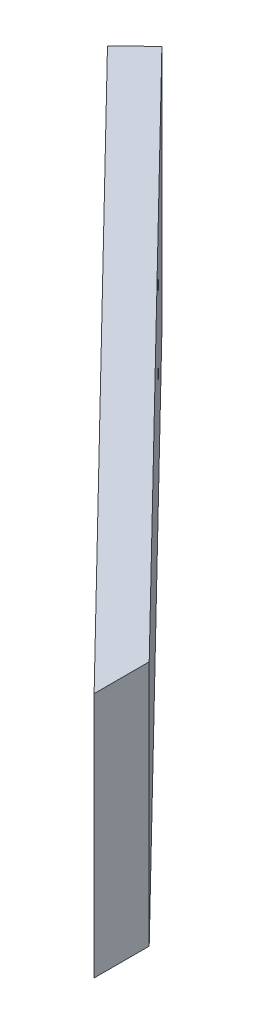
ISO-10303-21;
HEADER;
FILE_DESCRIPTION(('STEP AP214'),'2;1');
FILE_NAME('part.step','',(''),(''),'','','');
FILE_SCHEMA(('AUTOMOTIVE_DESIGN { 1 0 10303 214 1 1 1 1 }'));
ENDSEC;
DATA;
#1=APPLICATION_CONTEXT('core data for automotive mechanical design processes');
#2=APPLICATION_PROTOCOL_DEFINITION('international standard','automotive_design',2000,#1);
#3=PRODUCT_CONTEXT('',#1,'mechanical');
#4=PRODUCT('Part','Part','',(#3));
#5=PRODUCT_RELATED_PRODUCT_CATEGORY('part','',(#4));
#6=PRODUCT_DEFINITION_FORMATION('','',#4);
#7=PRODUCT_DEFINITION_CONTEXT('part definition',#1,'design');
#8=PRODUCT_DEFINITION('design','',#6,#7);
#9=PRODUCT_DEFINITION_SHAPE('','',#8);
#10=(LENGTH_UNIT() NAMED_UNIT(*) SI_UNIT(.MILLI.,.METRE.));
#11=(NAMED_UNIT(*) PLANE_ANGLE_UNIT() SI_UNIT($,.RADIAN.));
#12=(NAMED_UNIT(*) SI_UNIT($,.STERADIAN.) SOLID_ANGLE_UNIT());
#13=UNCERTAINTY_MEASURE_WITH_UNIT(LENGTH_MEASURE(1.E-05),#10,'distance_accuracy_value','');
#14=(GEOMETRIC_REPRESENTATION_CONTEXT(3) GLOBAL_UNCERTAINTY_ASSIGNED_CONTEXT((#13)) GLOBAL_UNIT_ASSIGNED_CONTEXT((#10,
#11,#12)) REPRESENTATION_CONTEXT('',''));
#15=CARTESIAN_POINT('',(0.,0.,0.));
#16=DIRECTION('',(0.,0.,1.));
#17=DIRECTION('',(1.,0.,0.));
#18=AXIS2_PLACEMENT_3D('',#15,#16,#17);
#19=CARTESIAN_POINT('',(0.,32.,30.));
#20=DIRECTION('',(0.715474021164313,0.,-0.698639338313388));
#21=DIRECTION('',(-0.698639338313388,0.,-0.715474021164313));
#22=AXIS2_PLACEMENT_3D('',#19,#20,#21);
#23=PLANE('',#22);
#24=CARTESIAN_POINT('',(45.2113149470892,7.,76.3007442229227));
#25=DIRECTION('',(0.715474021164313,0.,-0.698639338313388));
#26=DIRECTION('',(-0.698639338313388,0.,-0.715474021164313));
#27=AXIS2_PLACEMENT_3D('',#24,#25,#26);
#28=CIRCLE('',#27,1.10000000000001);
#29=CARTESIAN_POINT('',(44.4428116749445,7.,75.5137227996419));
#30=VERTEX_POINT('',#29);
#31=EDGE_CURVE('E111',#30,#30,#28,.T.);
#32=ORIENTED_EDGE('',*,*,#31,.T.);
#33=EDGE_LOOP('',(#32));
#34=FACE_BOUND('',#33,.T.);
#35=CARTESIAN_POINT('',(59.184101713357,15.,90.6102246462089));
#36=DIRECTION('',(0.715474021164313,0.,-0.698639338313388));
#37=DIRECTION('',(-0.698639338313388,0.,-0.715474021164313));
#38=AXIS2_PLACEMENT_3D('',#35,#36,#37);
#39=CIRCLE('',#38,1.10000000000002);
#40=CARTESIAN_POINT('',(58.4155984412122,15.,89.8232032229282));
#41=VERTEX_POINT('',#40);
#42=EDGE_CURVE('E116',#41,#41,#39,.T.);
#43=ORIENTED_EDGE('',*,*,#42,.T.);
#44=EDGE_LOOP('',(#43));
#45=FACE_BOUND('',#44,.T.);
#46=CARTESIAN_POINT('',(31.2385281808215,15.,61.9912637996364));
#47=DIRECTION('',(0.715474021164313,0.,-0.698639338313388));
#48=DIRECTION('',(-0.698639338313388,0.,-0.715474021164313));
#49=AXIS2_PLACEMENT_3D('',#46,#47,#48);
#50=CIRCLE('',#49,1.10000000000001);
#51=CARTESIAN_POINT('',(30.4700249086767,15.,61.2042423763557));
#52=VERTEX_POINT('',#51);
#53=EDGE_CURVE('E119',#52,#52,#50,.T.);
#54=ORIENTED_EDGE('',*,*,#53,.T.);
#55=EDGE_LOOP('',(#54));
#56=FACE_BOUND('',#55,.T.);
#57=CARTESIAN_POINT('',(59.184101713357,25.,90.6102246462089));
#58=DIRECTION('',(0.715474021164313,0.,-0.698639338313388));
#59=DIRECTION('',(-0.698639338313388,0.,-0.715474021164313));
#60=AXIS2_PLACEMENT_3D('',#57,#58,#59);
#61=CIRCLE('',#60,1.10000000000001);
#62=CARTESIAN_POINT('',(58.4155984412122,25.,89.8232032229282));
#63=VERTEX_POINT('',#62);
#64=EDGE_CURVE('E122',#63,#63,#61,.T.);
#65=ORIENTED_EDGE('',*,*,#64,.T.);
#66=EDGE_LOOP('',(#65));
#67=FACE_BOUND('',#66,.T.);
#68=CARTESIAN_POINT('',(45.2113149470892,17.,76.3007442229227));
#69=DIRECTION('',(0.715474021164313,0.,-0.698639338313388));
#70=DIRECTION('',(-0.698639338313388,0.,-0.715474021164313));
#71=AXIS2_PLACEMENT_3D('',#68,#69,#70);
#72=CIRCLE('',#71,1.10000000000001);
#73=CARTESIAN_POINT('',(44.4428116749445,17.,75.5137227996419));
#74=VERTEX_POINT('',#73);
#75=EDGE_CURVE('E125',#74,#74,#72,.T.);
#76=ORIENTED_EDGE('',*,*,#75,.T.);
#77=EDGE_LOOP('',(#76));
#78=FACE_BOUND('',#77,.T.);
#79=CARTESIAN_POINT('',(31.2385281808215,25.,61.9912637996364));
#80=DIRECTION('',(0.715474021164313,0.,-0.698639338313388));
#81=DIRECTION('',(-0.698639338313388,0.,-0.715474021164313));
#82=AXIS2_PLACEMENT_3D('',#79,#80,#81);
#83=CIRCLE('',#82,1.10000000000001);
#84=CARTESIAN_POINT('',(30.4700249086767,25.,61.2042423763557));
#85=VERTEX_POINT('',#84);
#86=EDGE_CURVE('E128',#85,#85,#83,.T.);
#87=ORIENTED_EDGE('',*,*,#86,.T.);
#88=EDGE_LOOP('',(#87));
#89=FACE_BOUND('',#88,.T.);
#90=CARTESIAN_POINT('',(13.0959180149402,26.,43.4114823044568));
#91=DIRECTION('',(0.715474021164313,0.,-0.698639338313388));
#92=DIRECTION('',(-0.698639338313388,0.,-0.715474021164313));
#93=AXIS2_PLACEMENT_3D('',#90,#91,#92);
#94=CIRCLE('',#93,1.1);
#95=CARTESIAN_POINT('',(12.3274147427955,26.,42.624460881176));
#96=VERTEX_POINT('',#95);
#97=EDGE_CURVE('E100',#96,#96,#94,.T.);
#98=ORIENTED_EDGE('',*,*,#97,.T.);
#99=EDGE_LOOP('',(#98));
#100=FACE_BOUND('',#99,.T.);
#101=CARTESIAN_POINT('',(13.0959180149402,6.,43.4114823044568));
#102=DIRECTION('',(0.715474021164313,0.,-0.698639338313388));
#103=DIRECTION('',(-0.698639338313388,0.,-0.715474021164313));
#104=AXIS2_PLACEMENT_3D('',#101,#102,#103);
#105=CIRCLE('',#104,1.1);
#106=CARTESIAN_POINT('',(12.3274147427955,6.,42.624460881176));
#107=VERTEX_POINT('',#106);
#108=EDGE_CURVE('E104',#107,#107,#105,.T.);
#109=ORIENTED_EDGE('',*,*,#108,.T.);
#110=EDGE_LOOP('',(#109));
#111=FACE_BOUND('',#110,.T.);
#112=DIRECTION('',(0.,1.,0.));
#113=VECTOR('',#112,1.);
#114=CARTESIAN_POINT('',(11.,0.,41.2650602409639));
#115=LINE('',#114,#113);
#116=CARTESIAN_POINT('',(11.,0.,41.2650602409639));
#117=VERTEX_POINT('',#116);
#118=CARTESIAN_POINT('',(11.,32.,41.2650602409639));
#119=VERTEX_POINT('',#118);
#120=EDGE_CURVE('E93',#117,#119,#115,.T.);
#121=ORIENTED_EDGE('',*,*,#120,.F.);
#122=DIRECTION('',(0.698639338313388,0.,0.715474021164313));
#123=VECTOR('',#122,1.);
#124=CARTESIAN_POINT('',(0.,0.,30.));
#125=LINE('',#124,#123);
#126=CARTESIAN_POINT('',(83.,0.,115.));
#127=VERTEX_POINT('',#126);
#128=EDGE_CURVE('E78',#117,#127,#125,.T.);
#129=ORIENTED_EDGE('',*,*,#128,.T.);
#130=DIRECTION('',(0.,-1.,0.));
#131=VECTOR('',#130,1.);
#132=CARTESIAN_POINT('',(83.,32.,115.));
#133=LINE('',#132,#131);
#134=CARTESIAN_POINT('',(83.,32.,115.));
#135=VERTEX_POINT('',#134);
#136=EDGE_CURVE('E11',#135,#127,#133,.T.);
#137=ORIENTED_EDGE('',*,*,#136,.F.);
#138=DIRECTION('',(0.698639338313388,0.,0.715474021164313));
#139=VECTOR('',#138,1.);
#140=CARTESIAN_POINT('',(0.,32.,30.));
#141=LINE('',#140,#139);
#142=EDGE_CURVE('E86',#119,#135,#141,.T.);
#143=ORIENTED_EDGE('',*,*,#142,.F.);
#144=EDGE_LOOP('',(#121,#129,#137,#143));
#145=FACE_BOUND('',#144,.T.);
#146=ADVANCED_FACE('F34',(#34,#45,#56,#67,#78,#89,#100,#111,#145),#23,.F.);
#147=CARTESIAN_POINT('',(5.,32.,27.9637134410254));
#148=DIRECTION('',(-0.715474021164313,0.,0.698639338313388));
#149=DIRECTION('',(0.698639338313388,0.,0.715474021164313));
#150=AXIS2_PLACEMENT_3D('',#147,#148,#149);
#151=PLANE('',#150);
#152=CARTESIAN_POINT('',(48.7886850529108,7.,72.8075475313557));
#153=DIRECTION('',(0.715474021164313,0.,-0.698639338313388));
#154=DIRECTION('',(0.698639338313388,0.,0.715474021164313));
#155=AXIS2_PLACEMENT_3D('',#152,#153,#154);
#156=CIRCLE('',#155,1.10000000000001);
#157=CARTESIAN_POINT('',(49.5571883250555,7.,73.5945689546365));
#158=VERTEX_POINT('',#157);
#159=EDGE_CURVE('E135',#158,#158,#156,.T.);
#160=ORIENTED_EDGE('',*,*,#159,.F.);
#161=EDGE_LOOP('',(#160));
#162=FACE_BOUND('',#161,.T.);
#163=CARTESIAN_POINT('',(62.7614718191785,15.,87.117027954642));
#164=DIRECTION('',(0.715474021164313,0.,-0.698639338313388));
#165=DIRECTION('',(-0.698639338313388,0.,-0.715474021164313));
#166=AXIS2_PLACEMENT_3D('',#163,#164,#165);
#167=CIRCLE('',#166,1.10000000000002);
#168=CARTESIAN_POINT('',(61.9929685470338,15.,86.3300065313612));
#169=VERTEX_POINT('',#168);
#170=EDGE_CURVE('E141',#169,#169,#167,.T.);
#171=ORIENTED_EDGE('',*,*,#170,.F.);
#172=EDGE_LOOP('',(#171));
#173=FACE_BOUND('',#172,.T.);
#174=CARTESIAN_POINT('',(34.815898286643,15.,58.4980671080695));
#175=DIRECTION('',(0.715474021164313,0.,-0.698639338313388));
#176=DIRECTION('',(0.698639338313388,0.,0.715474021164313));
#177=AXIS2_PLACEMENT_3D('',#174,#175,#176);
#178=CIRCLE('',#177,1.10000000000001);
#179=CARTESIAN_POINT('',(35.5844015587878,15.,59.2850885313502));
#180=VERTEX_POINT('',#179);
#181=EDGE_CURVE('E134',#180,#180,#178,.T.);
#182=ORIENTED_EDGE('',*,*,#181,.F.);
#183=EDGE_LOOP('',(#182));
#184=FACE_BOUND('',#183,.T.);
#185=CARTESIAN_POINT('',(62.7614718191785,25.,87.117027954642));
#186=DIRECTION('',(0.715474021164313,0.,-0.698639338313388));
#187=DIRECTION('',(0.698639338313388,0.,0.715474021164313));
#188=AXIS2_PLACEMENT_3D('',#185,#186,#187);
#189=CIRCLE('',#188,1.10000000000001);
#190=CARTESIAN_POINT('',(63.5299750913233,25.,87.9040493779227));
#191=VERTEX_POINT('',#190);
#192=EDGE_CURVE('E144',#191,#191,#189,.T.);
#193=ORIENTED_EDGE('',*,*,#192,.F.);
#194=EDGE_LOOP('',(#193));
#195=FACE_BOUND('',#194,.T.);
#196=CARTESIAN_POINT('',(48.7886850529108,17.,72.8075475313557));
#197=DIRECTION('',(0.715474021164313,0.,-0.698639338313388));
#198=DIRECTION('',(-0.698639338313388,0.,-0.715474021164313));
#199=AXIS2_PLACEMENT_3D('',#196,#197,#198);
#200=CIRCLE('',#199,1.10000000000001);
#201=CARTESIAN_POINT('',(48.020181780766,17.,72.020526108075));
#202=VERTEX_POINT('',#201);
#203=EDGE_CURVE('E138',#202,#202,#200,.T.);
#204=ORIENTED_EDGE('',*,*,#203,.F.);
#205=EDGE_LOOP('',(#204));
#206=FACE_BOUND('',#205,.T.);
#207=CARTESIAN_POINT('',(34.815898286643,25.,58.4980671080695));
#208=DIRECTION('',(0.715474021164313,0.,-0.698639338313388));
#209=DIRECTION('',(-0.698639338313388,0.,-0.715474021164313));
#210=AXIS2_PLACEMENT_3D('',#207,#208,#209);
#211=CIRCLE('',#210,1.10000000000001);
#212=CARTESIAN_POINT('',(34.0473950144983,25.,57.7110456847887));
#213=VERTEX_POINT('',#212);
#214=EDGE_CURVE('E131',#213,#213,#211,.T.);
#215=ORIENTED_EDGE('',*,*,#214,.F.);
#216=EDGE_LOOP('',(#215));
#217=FACE_BOUND('',#216,.T.);
#218=CARTESIAN_POINT('',(16.6732881207617,26.,39.9182856128899));
#219=DIRECTION('',(0.715474021164313,0.,-0.698639338313388));
#220=DIRECTION('',(-0.698639338313388,0.,-0.715474021164313));
#221=AXIS2_PLACEMENT_3D('',#218,#219,#220);
#222=CIRCLE('',#221,1.1);
#223=CARTESIAN_POINT('',(15.904784848617,26.,39.1312641896091));
#224=VERTEX_POINT('',#223);
#225=EDGE_CURVE('E107',#224,#224,#222,.T.);
#226=ORIENTED_EDGE('',*,*,#225,.F.);
#227=EDGE_LOOP('',(#226));
#228=FACE_BOUND('',#227,.T.);
#229=CARTESIAN_POINT('',(16.6732881207617,6.,39.9182856128899));
#230=DIRECTION('',(0.715474021164313,0.,-0.698639338313388));
#231=DIRECTION('',(0.698639338313388,0.,0.715474021164313));
#232=AXIS2_PLACEMENT_3D('',#229,#230,#231);
#233=CIRCLE('',#232,1.1);
#234=CARTESIAN_POINT('',(17.4417913929065,6.,40.7053070361706));
#235=VERTEX_POINT('',#234);
#236=EDGE_CURVE('E108',#235,#235,#233,.T.);
#237=ORIENTED_EDGE('',*,*,#236,.F.);
#238=EDGE_LOOP('',(#237));
#239=FACE_BOUND('',#238,.T.);
#240=DIRECTION('',(0.,1.,0.));
#241=VECTOR('',#240,1.);
#242=CARTESIAN_POINT('',(14.5773701058216,0.,37.7718635493969));
#243=LINE('',#242,#241);
#244=CARTESIAN_POINT('',(14.5773701058216,0.,37.7718635493969));
#245=VERTEX_POINT('',#244);
#246=CARTESIAN_POINT('',(14.5773701058216,32.,37.7718635493969));
#247=VERTEX_POINT('',#246);
#248=EDGE_CURVE('E48',#245,#247,#243,.T.);
#249=ORIENTED_EDGE('',*,*,#248,.T.);
#250=DIRECTION('',(-0.698639338313388,0.,-0.715474021164313));
#251=VECTOR('',#250,1.);
#252=CARTESIAN_POINT('',(5.,32.,27.9637134410254));
#253=LINE('',#252,#251);
#254=CARTESIAN_POINT('',(83.,32.,107.843231513315));
#255=VERTEX_POINT('',#254);
#256=EDGE_CURVE('E83',#255,#247,#253,.T.);
#257=ORIENTED_EDGE('',*,*,#256,.F.);
#258=DIRECTION('',(0.,-1.,0.));
#259=VECTOR('',#258,1.);
#260=CARTESIAN_POINT('',(83.,32.,107.843231513315));
#261=LINE('',#260,#259);
#262=CARTESIAN_POINT('',(83.,0.,107.843231513315));
#263=VERTEX_POINT('',#262);
#264=EDGE_CURVE('E41',#255,#263,#261,.T.);
#265=ORIENTED_EDGE('',*,*,#264,.T.);
#266=DIRECTION('',(-0.698639338313388,0.,-0.715474021164313));
#267=VECTOR('',#266,1.);
#268=CARTESIAN_POINT('',(5.,0.,27.9637134410254));
#269=LINE('',#268,#267);
#270=EDGE_CURVE('E77',#263,#245,#269,.T.);
#271=ORIENTED_EDGE('',*,*,#270,.T.);
#272=EDGE_LOOP('',(#249,#257,#265,#271));
#273=FACE_BOUND('',#272,.T.);
#274=ADVANCED_FACE('F82',(#162,#173,#184,#195,#206,#217,#228,#239,#273),#151,.F.);
#275=CARTESIAN_POINT('',(0.,32.,0.));
#276=DIRECTION('',(0.,-1.,0.));
#277=DIRECTION('',(0.,0.,-1.));
#278=AXIS2_PLACEMENT_3D('',#275,#276,#277);
#279=PLANE('',#278);
#280=DIRECTION('',(-0.715474021164312,0.,0.698639338313388));
#281=VECTOR('',#280,1.);
#282=CARTESIAN_POINT('',(14.5773701058216,32.,37.7718635493969));
#283=LINE('',#282,#281);
#284=EDGE_CURVE('E97',#247,#119,#283,.T.);
#285=ORIENTED_EDGE('',*,*,#284,.T.);
#286=ORIENTED_EDGE('',*,*,#142,.T.);
#287=DIRECTION('',(0.,0.,-1.));
#288=VECTOR('',#287,1.);
#289=CARTESIAN_POINT('',(83.,32.,115.));
#290=LINE('',#289,#288);
#291=EDGE_CURVE('E57',#135,#255,#290,.T.);
#292=ORIENTED_EDGE('',*,*,#291,.T.);
#293=ORIENTED_EDGE('',*,*,#256,.T.);
#294=EDGE_LOOP('',(#285,#286,#292,#293));
#295=FACE_BOUND('',#294,.T.);
#296=ADVANCED_FACE('F155',(#295),#279,.F.);
#297=CARTESIAN_POINT('',(0.,0.,0.));
#298=DIRECTION('',(0.,-1.,0.));
#299=DIRECTION('',(0.,0.,-1.));
#300=AXIS2_PLACEMENT_3D('',#297,#298,#299);
#301=PLANE('',#300);
#302=ORIENTED_EDGE('',*,*,#128,.F.);
#303=DIRECTION('',(-0.715474021164312,0.,0.698639338313388));
#304=VECTOR('',#303,1.);
#305=CARTESIAN_POINT('',(14.5773701058216,0.,37.7718635493969));
#306=LINE('',#305,#304);
#307=EDGE_CURVE('E85',#245,#117,#306,.T.);
#308=ORIENTED_EDGE('',*,*,#307,.F.);
#309=ORIENTED_EDGE('',*,*,#270,.F.);
#310=DIRECTION('',(0.,0.,-1.));
#311=VECTOR('',#310,1.);
#312=CARTESIAN_POINT('',(83.,0.,115.));
#313=LINE('',#312,#311);
#314=EDGE_CURVE('E69',#127,#263,#313,.T.);
#315=ORIENTED_EDGE('',*,*,#314,.F.);
#316=EDGE_LOOP('',(#302,#308,#309,#315));
#317=FACE_BOUND('',#316,.T.);
#318=ADVANCED_FACE('F84',(#317),#301,.T.);
#319=CARTESIAN_POINT('',(83.,32.,115.));
#320=DIRECTION('',(-1.,0.,0.));
#321=DIRECTION('',(0.,0.,1.));
#322=AXIS2_PLACEMENT_3D('',#319,#320,#321);
#323=PLANE('',#322);
#324=ORIENTED_EDGE('',*,*,#314,.T.);
#325=ORIENTED_EDGE('',*,*,#264,.F.);
#326=ORIENTED_EDGE('',*,*,#291,.F.);
#327=ORIENTED_EDGE('',*,*,#136,.T.);
#328=EDGE_LOOP('',(#324,#325,#326,#327));
#329=FACE_BOUND('',#328,.T.);
#330=ADVANCED_FACE('F71',(#329),#323,.F.);
#331=CARTESIAN_POINT('',(14.5773701058216,0.,37.7718635493969));
#332=DIRECTION('',(-0.698639338313388,0.,-0.715474021164312));
#333=DIRECTION('',(-0.715474021164312,0.,0.698639338313388));
#334=AXIS2_PLACEMENT_3D('',#331,#332,#333);
#335=PLANE('',#334);
#336=ORIENTED_EDGE('',*,*,#284,.F.);
#337=ORIENTED_EDGE('',*,*,#248,.F.);
#338=ORIENTED_EDGE('',*,*,#307,.T.);
#339=ORIENTED_EDGE('',*,*,#120,.T.);
#340=EDGE_LOOP('',(#336,#337,#338,#339));
#341=FACE_BOUND('',#340,.T.);
#342=ADVANCED_FACE('F170',(#341),#335,.T.);
#343=CARTESIAN_POINT('',(-23.7611033822541,6.,79.4012796687759));
#344=DIRECTION('',(0.715474021164313,0.,-0.698639338313388));
#345=DIRECTION('',(-0.698639338313388,0.,-0.715474021164313));
#346=AXIS2_PLACEMENT_3D('',#343,#344,#345);
#347=CYLINDRICAL_SURFACE('',#346,1.1);
#348=ORIENTED_EDGE('',*,*,#236,.T.);
#349=EDGE_LOOP('',(#348));
#350=FACE_BOUND('',#349,.T.);
#351=ORIENTED_EDGE('',*,*,#108,.F.);
#352=EDGE_LOOP('',(#351));
#353=FACE_BOUND('',#352,.T.);
#354=ADVANCED_FACE('F166',(#350,#353),#347,.F.);
#355=CARTESIAN_POINT('',(-23.7611033822541,26.,79.4012796687759));
#356=DIRECTION('',(0.715474021164313,0.,-0.698639338313388));
#357=DIRECTION('',(-0.698639338313388,0.,-0.715474021164313));
#358=AXIS2_PLACEMENT_3D('',#355,#356,#357);
#359=CYLINDRICAL_SURFACE('',#358,1.1);
#360=ORIENTED_EDGE('',*,*,#225,.T.);
#361=EDGE_LOOP('',(#360));
#362=FACE_BOUND('',#361,.T.);
#363=ORIENTED_EDGE('',*,*,#97,.F.);
#364=EDGE_LOOP('',(#363));
#365=FACE_BOUND('',#364,.T.);
#366=ADVANCED_FACE('F169',(#362,#365),#359,.F.);
#367=CARTESIAN_POINT('',(-5.61849321637282,25.,97.9810611639556));
#368=DIRECTION('',(0.715474021164313,0.,-0.698639338313388));
#369=DIRECTION('',(-0.698639338313388,0.,-0.715474021164313));
#370=AXIS2_PLACEMENT_3D('',#367,#368,#369);
#371=CYLINDRICAL_SURFACE('',#370,1.10000000000001);
#372=ORIENTED_EDGE('',*,*,#214,.T.);
#373=EDGE_LOOP('',(#372));
#374=FACE_BOUND('',#373,.T.);
#375=ORIENTED_EDGE('',*,*,#86,.F.);
#376=EDGE_LOOP('',(#375));
#377=FACE_BOUND('',#376,.T.);
#378=ADVANCED_FACE('F207',(#374,#377),#371,.F.);
#379=CARTESIAN_POINT('',(8.35429354989493,17.,112.290541587242));
#380=DIRECTION('',(0.715474021164313,0.,-0.698639338313388));
#381=DIRECTION('',(-0.698639338313388,0.,-0.715474021164313));
#382=AXIS2_PLACEMENT_3D('',#379,#380,#381);
#383=CYLINDRICAL_SURFACE('',#382,1.10000000000001);
#384=ORIENTED_EDGE('',*,*,#203,.T.);
#385=EDGE_LOOP('',(#384));
#386=FACE_BOUND('',#385,.T.);
#387=ORIENTED_EDGE('',*,*,#75,.F.);
#388=EDGE_LOOP('',(#387));
#389=FACE_BOUND('',#388,.T.);
#390=ADVANCED_FACE('F216',(#386,#389),#383,.F.);
#391=CARTESIAN_POINT('',(22.3270803161627,25.,126.600022010528));
#392=DIRECTION('',(0.715474021164313,0.,-0.698639338313388));
#393=DIRECTION('',(-0.698639338313388,0.,-0.715474021164313));
#394=AXIS2_PLACEMENT_3D('',#391,#392,#393);
#395=CYLINDRICAL_SURFACE('',#394,1.10000000000001);
#396=ORIENTED_EDGE('',*,*,#192,.T.);
#397=EDGE_LOOP('',(#396));
#398=FACE_BOUND('',#397,.T.);
#399=ORIENTED_EDGE('',*,*,#64,.F.);
#400=EDGE_LOOP('',(#399));
#401=FACE_BOUND('',#400,.T.);
#402=ADVANCED_FACE('F150',(#398,#401),#395,.F.);
#403=CARTESIAN_POINT('',(-5.61849321637282,15.,97.9810611639556));
#404=DIRECTION('',(0.715474021164313,0.,-0.698639338313388));
#405=DIRECTION('',(-0.698639338313388,0.,-0.715474021164313));
#406=AXIS2_PLACEMENT_3D('',#403,#404,#405);
#407=CYLINDRICAL_SURFACE('',#406,1.10000000000001);
#408=ORIENTED_EDGE('',*,*,#181,.T.);
#409=EDGE_LOOP('',(#408));
#410=FACE_BOUND('',#409,.T.);
#411=ORIENTED_EDGE('',*,*,#53,.F.);
#412=EDGE_LOOP('',(#411));
#413=FACE_BOUND('',#412,.T.);
#414=ADVANCED_FACE('F232',(#410,#413),#407,.F.);
#415=CARTESIAN_POINT('',(22.3270803161627,15.,126.600022010528));
#416=DIRECTION('',(0.715474021164313,0.,-0.698639338313388));
#417=DIRECTION('',(-0.698639338313388,0.,-0.715474021164313));
#418=AXIS2_PLACEMENT_3D('',#415,#416,#417);
#419=CYLINDRICAL_SURFACE('',#418,1.10000000000002);
#420=ORIENTED_EDGE('',*,*,#170,.T.);
#421=EDGE_LOOP('',(#420));
#422=FACE_BOUND('',#421,.T.);
#423=ORIENTED_EDGE('',*,*,#42,.F.);
#424=EDGE_LOOP('',(#423));
#425=FACE_BOUND('',#424,.T.);
#426=ADVANCED_FACE('F239',(#422,#425),#419,.F.);
#427=CARTESIAN_POINT('',(8.35429354989493,7.,112.290541587242));
#428=DIRECTION('',(0.715474021164313,0.,-0.698639338313388));
#429=DIRECTION('',(-0.698639338313388,0.,-0.715474021164313));
#430=AXIS2_PLACEMENT_3D('',#427,#428,#429);
#431=CYLINDRICAL_SURFACE('',#430,1.10000000000001);
#432=ORIENTED_EDGE('',*,*,#159,.T.);
#433=EDGE_LOOP('',(#432));
#434=FACE_BOUND('',#433,.T.);
#435=ORIENTED_EDGE('',*,*,#31,.F.);
#436=EDGE_LOOP('',(#435));
#437=FACE_BOUND('',#436,.T.);
#438=ADVANCED_FACE('F247',(#434,#437),#431,.F.);
#439=CLOSED_SHELL('',(#146,#274,#296,#318,#330,#342,#354,#366,#378,#390,#402,#414,#426,#438));
#440=MANIFOLD_SOLID_BREP('B2',#439);
#441=ADVANCED_BREP_SHAPE_REPRESENTATION('',(#18,#440),#14);
#442=SHAPE_DEFINITION_REPRESENTATION(#9,#441);
ENDSEC;
END-ISO-10303-21;
